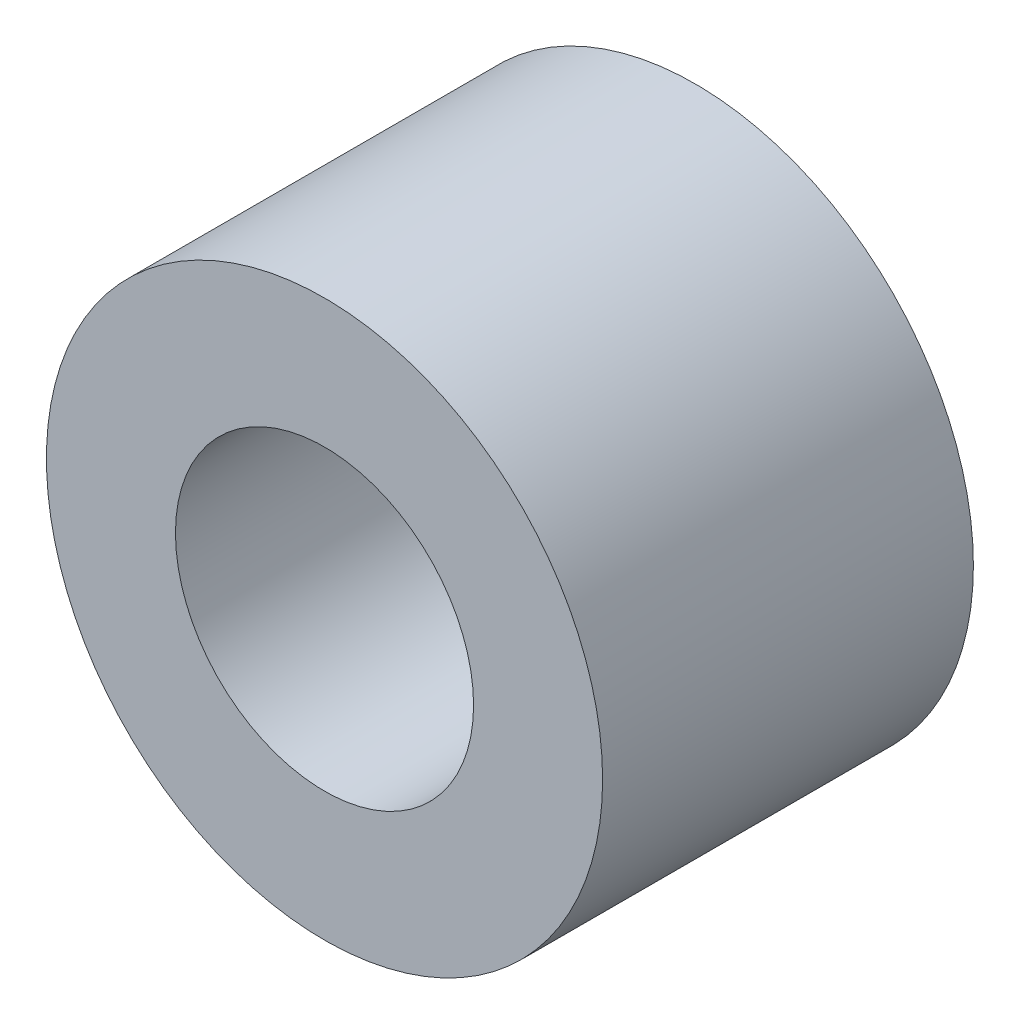
ISO-10303-21;
HEADER;
FILE_DESCRIPTION(('STEP AP214'),'2;1');
FILE_NAME('part.step','',(''),(''),'','','');
FILE_SCHEMA(('AUTOMOTIVE_DESIGN { 1 0 10303 214 1 1 1 1 }'));
ENDSEC;
DATA;
#1=APPLICATION_CONTEXT('core data for automotive mechanical design processes');
#2=APPLICATION_PROTOCOL_DEFINITION('international standard','automotive_design',2000,#1);
#3=PRODUCT_CONTEXT('',#1,'mechanical');
#4=PRODUCT('Part','Part','',(#3));
#5=PRODUCT_RELATED_PRODUCT_CATEGORY('part','',(#4));
#6=PRODUCT_DEFINITION_FORMATION('','',#4);
#7=PRODUCT_DEFINITION_CONTEXT('part definition',#1,'design');
#8=PRODUCT_DEFINITION('design','',#6,#7);
#9=PRODUCT_DEFINITION_SHAPE('','',#8);
#10=(LENGTH_UNIT() NAMED_UNIT(*) SI_UNIT(.MILLI.,.METRE.));
#11=(NAMED_UNIT(*) PLANE_ANGLE_UNIT() SI_UNIT($,.RADIAN.));
#12=(NAMED_UNIT(*) SI_UNIT($,.STERADIAN.) SOLID_ANGLE_UNIT());
#13=UNCERTAINTY_MEASURE_WITH_UNIT(LENGTH_MEASURE(1.E-05),#10,'distance_accuracy_value','');
#14=(GEOMETRIC_REPRESENTATION_CONTEXT(3) GLOBAL_UNCERTAINTY_ASSIGNED_CONTEXT((#13)) GLOBAL_UNIT_ASSIGNED_CONTEXT((#10,
#11,#12)) REPRESENTATION_CONTEXT('',''));
#15=CARTESIAN_POINT('',(0.,0.,0.));
#16=DIRECTION('',(0.,0.,1.));
#17=DIRECTION('',(1.,0.,0.));
#18=AXIS2_PLACEMENT_3D('',#15,#16,#17);
#19=CARTESIAN_POINT('',(0.,0.,3.175));
#20=DIRECTION('',(0.,0.,1.));
#21=DIRECTION('',(1.,0.,0.));
#22=AXIS2_PLACEMENT_3D('',#19,#20,#21);
#23=PLANE('',#22);
#24=CARTESIAN_POINT('',(0.,0.,3.175));
#25=DIRECTION('',(0.,0.,1.));
#26=DIRECTION('',(1.,0.,0.));
#27=AXIS2_PLACEMENT_3D('',#24,#25,#26);
#28=CIRCLE('',#27,4.7625);
#29=CARTESIAN_POINT('',(4.7625,0.,3.175));
#30=VERTEX_POINT('',#29);
#31=EDGE_CURVE('E10',#30,#30,#28,.T.);
#32=ORIENTED_EDGE('',*,*,#31,.T.);
#33=EDGE_LOOP('',(#32));
#34=FACE_BOUND('',#33,.T.);
#35=CARTESIAN_POINT('',(0.,0.,3.175));
#36=DIRECTION('',(0.,0.,1.));
#37=DIRECTION('',(1.,0.,0.));
#38=AXIS2_PLACEMENT_3D('',#35,#36,#37);
#39=CIRCLE('',#38,2.5527);
#40=CARTESIAN_POINT('',(2.5527,0.,3.175));
#41=VERTEX_POINT('',#40);
#42=EDGE_CURVE('E54',#41,#41,#39,.T.);
#43=ORIENTED_EDGE('',*,*,#42,.F.);
#44=EDGE_LOOP('',(#43));
#45=FACE_BOUND('',#44,.T.);
#46=ADVANCED_FACE('F41',(#34,#45),#23,.T.);
#47=CARTESIAN_POINT('',(0.,0.,-3.175));
#48=DIRECTION('',(0.,0.,1.));
#49=DIRECTION('',(1.,0.,0.));
#50=AXIS2_PLACEMENT_3D('',#47,#48,#49);
#51=PLANE('',#50);
#52=CARTESIAN_POINT('',(0.,0.,-3.175));
#53=DIRECTION('',(0.,0.,1.));
#54=DIRECTION('',(1.,0.,0.));
#55=AXIS2_PLACEMENT_3D('',#52,#53,#54);
#56=CIRCLE('',#55,4.7625);
#57=CARTESIAN_POINT('',(4.7625,0.,-3.175));
#58=VERTEX_POINT('',#57);
#59=EDGE_CURVE('E45',#58,#58,#56,.T.);
#60=ORIENTED_EDGE('',*,*,#59,.F.);
#61=EDGE_LOOP('',(#60));
#62=FACE_BOUND('',#61,.T.);
#63=CARTESIAN_POINT('',(0.,0.,-3.175));
#64=DIRECTION('',(0.,0.,1.));
#65=DIRECTION('',(1.,0.,0.));
#66=AXIS2_PLACEMENT_3D('',#63,#64,#65);
#67=CIRCLE('',#66,2.5527);
#68=CARTESIAN_POINT('',(2.5527,0.,-3.175));
#69=VERTEX_POINT('',#68);
#70=EDGE_CURVE('E56',#69,#69,#67,.T.);
#71=ORIENTED_EDGE('',*,*,#70,.T.);
#72=EDGE_LOOP('',(#71));
#73=FACE_BOUND('',#72,.T.);
#74=ADVANCED_FACE('F68',(#62,#73),#51,.F.);
#75=CARTESIAN_POINT('',(0.,0.,3.175));
#76=DIRECTION('',(0.,0.,-1.));
#77=DIRECTION('',(-1.,0.,0.));
#78=AXIS2_PLACEMENT_3D('',#75,#76,#77);
#79=CYLINDRICAL_SURFACE('',#78,4.7625);
#80=ORIENTED_EDGE('',*,*,#31,.F.);
#81=EDGE_LOOP('',(#80));
#82=FACE_BOUND('',#81,.T.);
#83=ORIENTED_EDGE('',*,*,#59,.T.);
#84=EDGE_LOOP('',(#83));
#85=FACE_BOUND('',#84,.T.);
#86=ADVANCED_FACE('F43',(#82,#85),#79,.T.);
#87=CARTESIAN_POINT('',(0.,0.,3.175));
#88=DIRECTION('',(0.,0.,-1.));
#89=DIRECTION('',(-1.,0.,0.));
#90=AXIS2_PLACEMENT_3D('',#87,#88,#89);
#91=CYLINDRICAL_SURFACE('',#90,2.5527);
#92=ORIENTED_EDGE('',*,*,#42,.T.);
#93=EDGE_LOOP('',(#92));
#94=FACE_BOUND('',#93,.T.);
#95=ORIENTED_EDGE('',*,*,#70,.F.);
#96=EDGE_LOOP('',(#95));
#97=FACE_BOUND('',#96,.T.);
#98=ADVANCED_FACE('F64',(#94,#97),#91,.F.);
#99=CLOSED_SHELL('',(#46,#74,#86,#98));
#100=MANIFOLD_SOLID_BREP('B2',#99);
#101=ADVANCED_BREP_SHAPE_REPRESENTATION('',(#18,#100),#14);
#102=SHAPE_DEFINITION_REPRESENTATION(#9,#101);
ENDSEC;
END-ISO-10303-21;
